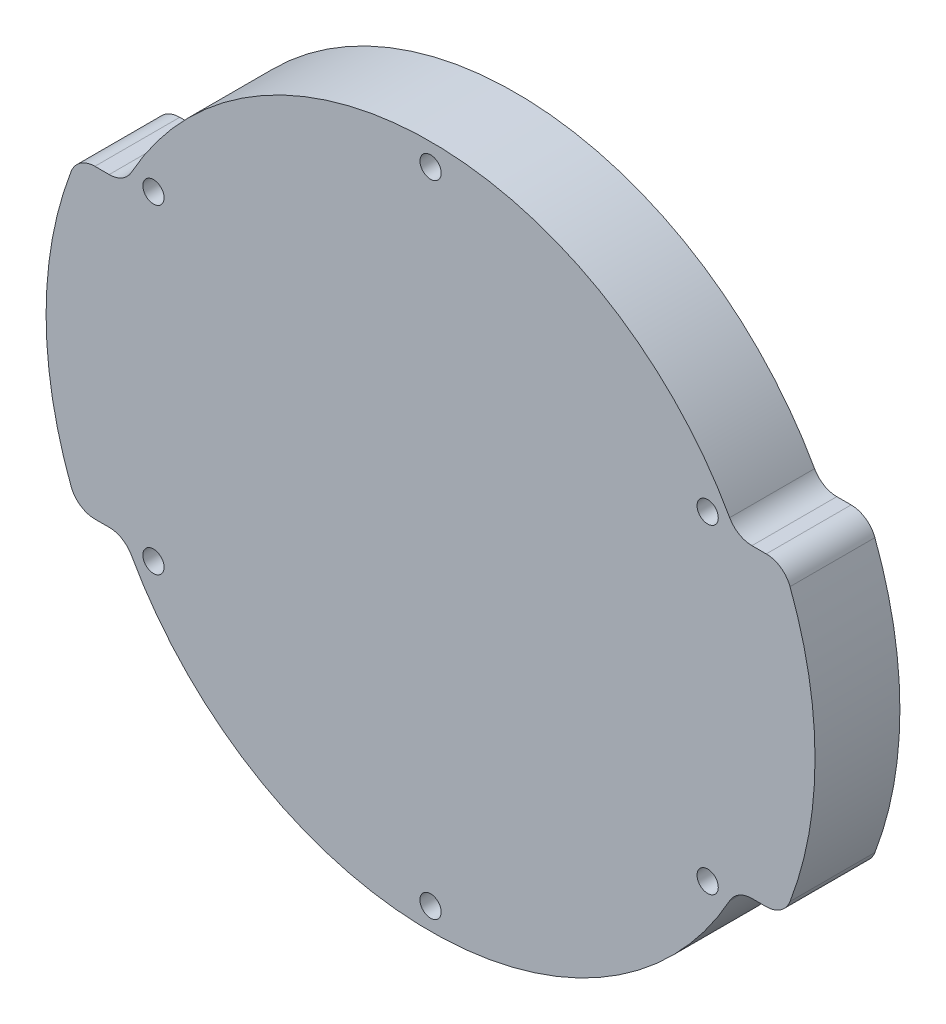
ISO-10303-21;
HEADER;
FILE_DESCRIPTION(('STEP AP214'),'2;1');
FILE_NAME('part.step','',(''),(''),'','','');
FILE_SCHEMA(('AUTOMOTIVE_DESIGN { 1 0 10303 214 1 1 1 1 }'));
ENDSEC;
DATA;
#1=APPLICATION_CONTEXT('core data for automotive mechanical design processes');
#2=APPLICATION_PROTOCOL_DEFINITION('international standard','automotive_design',2000,#1);
#3=PRODUCT_CONTEXT('',#1,'mechanical');
#4=PRODUCT('Part','Part','',(#3));
#5=PRODUCT_RELATED_PRODUCT_CATEGORY('part','',(#4));
#6=PRODUCT_DEFINITION_FORMATION('','',#4);
#7=PRODUCT_DEFINITION_CONTEXT('part definition',#1,'design');
#8=PRODUCT_DEFINITION('design','',#6,#7);
#9=PRODUCT_DEFINITION_SHAPE('','',#8);
#10=(LENGTH_UNIT() NAMED_UNIT(*) SI_UNIT(.MILLI.,.METRE.));
#11=(NAMED_UNIT(*) PLANE_ANGLE_UNIT() SI_UNIT($,.RADIAN.));
#12=(NAMED_UNIT(*) SI_UNIT($,.STERADIAN.) SOLID_ANGLE_UNIT());
#13=UNCERTAINTY_MEASURE_WITH_UNIT(LENGTH_MEASURE(1.E-05),#10,'distance_accuracy_value','');
#14=(GEOMETRIC_REPRESENTATION_CONTEXT(3) GLOBAL_UNCERTAINTY_ASSIGNED_CONTEXT((#13)) GLOBAL_UNIT_ASSIGNED_CONTEXT((#10,
#11,#12)) REPRESENTATION_CONTEXT('',''));
#15=CARTESIAN_POINT('',(0.,0.,0.));
#16=DIRECTION('',(0.,0.,1.));
#17=DIRECTION('',(1.,0.,0.));
#18=AXIS2_PLACEMENT_3D('',#15,#16,#17);
#19=CARTESIAN_POINT('',(0.,0.,10.));
#20=DIRECTION('',(0.,0.,-1.));
#21=DIRECTION('',(-1.,0.,0.));
#22=AXIS2_PLACEMENT_3D('',#19,#20,#21);
#23=CYLINDRICAL_SURFACE('',#22,45.3);
#24=CARTESIAN_POINT('',(0.,0.,0.));
#25=DIRECTION('',(0.,0.,1.));
#26=DIRECTION('',(1.,0.,0.));
#27=AXIS2_PLACEMENT_3D('',#24,#25,#26);
#28=CIRCLE('',#27,45.3);
#29=CARTESIAN_POINT('',(42.3561491706549,-16.063829787234,0.));
#30=VERTEX_POINT('',#29);
#31=CARTESIAN_POINT('',(42.3561491706549,16.063829787234,0.));
#32=VERTEX_POINT('',#31);
#33=EDGE_CURVE('E191',#30,#32,#28,.T.);
#34=ORIENTED_EDGE('',*,*,#33,.T.);
#35=DIRECTION('',(0.,0.,-1.));
#36=VECTOR('',#35,1.);
#37=CARTESIAN_POINT('',(42.3561491706549,16.063829787234,10.));
#38=LINE('',#37,#36);
#39=CARTESIAN_POINT('',(42.3561491706549,16.063829787234,10.));
#40=VERTEX_POINT('',#39);
#41=EDGE_CURVE('E201',#32,#40,#38,.F.);
#42=ORIENTED_EDGE('',*,*,#41,.T.);
#43=CARTESIAN_POINT('',(0.,0.,10.));
#44=DIRECTION('',(0.,0.,1.));
#45=DIRECTION('',(1.,0.,0.));
#46=AXIS2_PLACEMENT_3D('',#43,#44,#45);
#47=CIRCLE('',#46,45.3);
#48=CARTESIAN_POINT('',(42.3561491706549,-16.063829787234,10.));
#49=VERTEX_POINT('',#48);
#50=EDGE_CURVE('E187',#49,#40,#47,.T.);
#51=ORIENTED_EDGE('',*,*,#50,.F.);
#52=DIRECTION('',(0.,0.,-1.));
#53=VECTOR('',#52,1.);
#54=CARTESIAN_POINT('',(42.3561491706549,-16.063829787234,10.));
#55=LINE('',#54,#53);
#56=EDGE_CURVE('E198',#49,#30,#55,.T.);
#57=ORIENTED_EDGE('',*,*,#56,.T.);
#58=EDGE_LOOP('',(#34,#42,#51,#57));
#59=FACE_BOUND('',#58,.T.);
#60=ADVANCED_FACE('F33',(#59),#23,.T.);
#61=CARTESIAN_POINT('',(-42.3561491706549,16.063829787234,0.));
#62=VERTEX_POINT('',#61);
#63=CARTESIAN_POINT('',(-42.3561491706549,-16.063829787234,0.));
#64=VERTEX_POINT('',#63);
#65=EDGE_CURVE('E188',#62,#64,#28,.T.);
#66=ORIENTED_EDGE('',*,*,#65,.T.);
#67=DIRECTION('',(0.,0.,-1.));
#68=VECTOR('',#67,1.);
#69=CARTESIAN_POINT('',(-42.3561491706549,-16.063829787234,10.));
#70=LINE('',#69,#68);
#71=CARTESIAN_POINT('',(-42.3561491706549,-16.063829787234,10.));
#72=VERTEX_POINT('',#71);
#73=EDGE_CURVE('E234',#64,#72,#70,.F.);
#74=ORIENTED_EDGE('',*,*,#73,.T.);
#75=CARTESIAN_POINT('',(-42.3561491706549,16.063829787234,10.));
#76=VERTEX_POINT('',#75);
#77=EDGE_CURVE('E183',#76,#72,#47,.T.);
#78=ORIENTED_EDGE('',*,*,#77,.F.);
#79=DIRECTION('',(0.,0.,-1.));
#80=VECTOR('',#79,1.);
#81=CARTESIAN_POINT('',(-42.3561491706549,16.063829787234,10.));
#82=LINE('',#81,#80);
#83=EDGE_CURVE('E232',#76,#62,#82,.T.);
#84=ORIENTED_EDGE('',*,*,#83,.T.);
#85=EDGE_LOOP('',(#66,#74,#78,#84));
#86=FACE_BOUND('',#85,.T.);
#87=ADVANCED_FACE('F287',(#86),#23,.T.);
#88=CARTESIAN_POINT('',(0.,0.,10.));
#89=DIRECTION('',(0.,0.,1.));
#90=DIRECTION('',(1.,0.,0.));
#91=AXIS2_PLACEMENT_3D('',#88,#89,#90);
#92=PLANE('',#91);
#93=CARTESIAN_POINT('',(-32.6491577226728,18.8499999999991,10.));
#94=DIRECTION('',(0.,0.,1.));
#95=DIRECTION('',(1.,0.,0.));
#96=AXIS2_PLACEMENT_3D('',#93,#94,#95);
#97=CIRCLE('',#96,1.25000000000123);
#98=CARTESIAN_POINT('',(-31.3991577226716,18.8499999999991,10.));
#99=VERTEX_POINT('',#98);
#100=EDGE_CURVE('E348',#99,#99,#97,.T.);
#101=ORIENTED_EDGE('',*,*,#100,.F.);
#102=EDGE_LOOP('',(#101));
#103=FACE_BOUND('',#102,.T.);
#104=CARTESIAN_POINT('',(-32.6491577226717,-18.8500000000009,10.));
#105=DIRECTION('',(0.,0.,1.));
#106=DIRECTION('',(1.,0.,0.));
#107=AXIS2_PLACEMENT_3D('',#104,#105,#106);
#108=CIRCLE('',#107,1.25000000000215);
#109=CARTESIAN_POINT('',(-31.3991577226696,-18.8500000000009,10.));
#110=VERTEX_POINT('',#109);
#111=EDGE_CURVE('E350',#110,#110,#108,.T.);
#112=ORIENTED_EDGE('',*,*,#111,.F.);
#113=EDGE_LOOP('',(#112));
#114=FACE_BOUND('',#113,.T.);
#115=CARTESIAN_POINT('',(2.13376305418689E-12,-37.7,10.));
#116=DIRECTION('',(0.,0.,1.));
#117=DIRECTION('',(1.,0.,0.));
#118=AXIS2_PLACEMENT_3D('',#115,#116,#117);
#119=CIRCLE('',#118,1.25000000000229);
#120=CARTESIAN_POINT('',(1.25000000000443,-37.7,10.));
#121=VERTEX_POINT('',#120);
#122=EDGE_CURVE('E356',#121,#121,#119,.T.);
#123=ORIENTED_EDGE('',*,*,#122,.F.);
#124=EDGE_LOOP('',(#123));
#125=FACE_BOUND('',#124,.T.);
#126=CARTESIAN_POINT('',(32.6491577226749,-18.8499999999991,10.));
#127=DIRECTION('',(0.,0.,1.));
#128=DIRECTION('',(1.,0.,0.));
#129=AXIS2_PLACEMENT_3D('',#126,#127,#128);
#130=CIRCLE('',#129,1.25000000000144);
#131=CARTESIAN_POINT('',(33.8991577226764,-18.8499999999991,10.));
#132=VERTEX_POINT('',#131);
#133=EDGE_CURVE('E362',#132,#132,#130,.T.);
#134=ORIENTED_EDGE('',*,*,#133,.F.);
#135=EDGE_LOOP('',(#134));
#136=FACE_BOUND('',#135,.T.);
#137=CARTESIAN_POINT('',(32.6491577226739,18.8500000000009,10.));
#138=DIRECTION('',(0.,0.,1.));
#139=DIRECTION('',(1.,0.,0.));
#140=AXIS2_PLACEMENT_3D('',#137,#138,#139);
#141=CIRCLE('',#140,1.25000000000034);
#142=CARTESIAN_POINT('',(33.8991577226742,18.8500000000009,10.));
#143=VERTEX_POINT('',#142);
#144=EDGE_CURVE('E368',#143,#143,#141,.T.);
#145=ORIENTED_EDGE('',*,*,#144,.F.);
#146=EDGE_LOOP('',(#145));
#147=FACE_BOUND('',#146,.T.);
#148=CARTESIAN_POINT('',(0.,37.7,10.));
#149=DIRECTION('',(0.,0.,1.));
#150=DIRECTION('',(1.,0.,0.));
#151=AXIS2_PLACEMENT_3D('',#148,#149,#150);
#152=CIRCLE('',#151,1.25);
#153=CARTESIAN_POINT('',(1.25,37.7,10.));
#154=VERTEX_POINT('',#153);
#155=EDGE_CURVE('E374',#154,#154,#152,.T.);
#156=ORIENTED_EDGE('',*,*,#155,.F.);
#157=EDGE_LOOP('',(#156));
#158=FACE_BOUND('',#157,.T.);
#159=ORIENTED_EDGE('',*,*,#50,.T.);
#160=CARTESIAN_POINT('',(39.5511061792208,15.,10.));
#161=DIRECTION('',(0.,0.,1.));
#162=DIRECTION('',(1.,0.,0.));
#163=AXIS2_PLACEMENT_3D('',#160,#161,#162);
#164=CIRCLE('',#163,3.);
#165=CARTESIAN_POINT('',(39.5511061792208,18.,10.));
#166=VERTEX_POINT('',#165);
#167=EDGE_CURVE('E173',#40,#166,#164,.T.);
#168=ORIENTED_EDGE('',*,*,#167,.T.);
#169=DIRECTION('',(1.,0.,0.));
#170=VECTOR('',#169,1.);
#171=CARTESIAN_POINT('',(36.0567608084808,18.,10.));
#172=LINE('',#171,#170);
#173=CARTESIAN_POINT('',(37.8667400234031,18.,10.));
#174=VERTEX_POINT('',#173);
#175=EDGE_CURVE('E164',#174,#166,#172,.T.);
#176=ORIENTED_EDGE('',*,*,#175,.F.);
#177=CARTESIAN_POINT('',(37.8667400234031,21.,10.));
#178=DIRECTION('',(0.,0.,1.));
#179=DIRECTION('',(1.,0.,0.));
#180=AXIS2_PLACEMENT_3D('',#177,#178,#179);
#181=CIRCLE('',#180,3.);
#182=CARTESIAN_POINT('',(35.2431783589641,19.5450346420323,10.));
#183=VERTEX_POINT('',#182);
#184=EDGE_CURVE('E147',#174,#183,#181,.F.);
#185=ORIENTED_EDGE('',*,*,#184,.T.);
#186=CARTESIAN_POINT('',(0.,0.,10.));
#187=DIRECTION('',(0.,0.,-1.));
#188=DIRECTION('',(1.,0.,0.));
#189=AXIS2_PLACEMENT_3D('',#186,#187,#188);
#190=CIRCLE('',#189,40.3);
#191=CARTESIAN_POINT('',(-35.2431783589641,19.5450346420323,10.));
#192=VERTEX_POINT('',#191);
#193=EDGE_CURVE('E175',#192,#183,#190,.T.);
#194=ORIENTED_EDGE('',*,*,#193,.F.);
#195=CARTESIAN_POINT('',(-37.8667400234031,21.,10.));
#196=DIRECTION('',(0.,0.,1.));
#197=DIRECTION('',(1.,0.,0.));
#198=AXIS2_PLACEMENT_3D('',#195,#196,#197);
#199=CIRCLE('',#198,3.);
#200=CARTESIAN_POINT('',(-37.8667400234031,18.,10.));
#201=VERTEX_POINT('',#200);
#202=EDGE_CURVE('E41',#192,#201,#199,.F.);
#203=ORIENTED_EDGE('',*,*,#202,.T.);
#204=DIRECTION('',(1.,0.,0.));
#205=VECTOR('',#204,1.);
#206=CARTESIAN_POINT('',(-36.0567608084808,18.,10.));
#207=LINE('',#206,#205);
#208=CARTESIAN_POINT('',(-39.5511061792208,18.,10.));
#209=VERTEX_POINT('',#208);
#210=EDGE_CURVE('E174',#209,#201,#207,.T.);
#211=ORIENTED_EDGE('',*,*,#210,.F.);
#212=CARTESIAN_POINT('',(-39.5511061792208,15.,10.));
#213=DIRECTION('',(0.,0.,1.));
#214=DIRECTION('',(1.,0.,0.));
#215=AXIS2_PLACEMENT_3D('',#212,#213,#214);
#216=CIRCLE('',#215,3.);
#217=EDGE_CURVE('E204',#209,#76,#216,.T.);
#218=ORIENTED_EDGE('',*,*,#217,.T.);
#219=ORIENTED_EDGE('',*,*,#77,.T.);
#220=CARTESIAN_POINT('',(-39.5511061792208,-15.,10.));
#221=DIRECTION('',(0.,0.,1.));
#222=DIRECTION('',(1.,0.,0.));
#223=AXIS2_PLACEMENT_3D('',#220,#221,#222);
#224=CIRCLE('',#223,3.);
#225=CARTESIAN_POINT('',(-39.5511061792208,-18.,10.));
#226=VERTEX_POINT('',#225);
#227=EDGE_CURVE('E206',#72,#226,#224,.T.);
#228=ORIENTED_EDGE('',*,*,#227,.T.);
#229=DIRECTION('',(-1.,0.,0.));
#230=VECTOR('',#229,1.);
#231=CARTESIAN_POINT('',(-36.0567608084808,-18.,10.));
#232=LINE('',#231,#230);
#233=CARTESIAN_POINT('',(-37.8667400234031,-18.,10.));
#234=VERTEX_POINT('',#233);
#235=EDGE_CURVE('E389',#234,#226,#232,.T.);
#236=ORIENTED_EDGE('',*,*,#235,.F.);
#237=CARTESIAN_POINT('',(-37.8667400234031,-21.,10.));
#238=DIRECTION('',(0.,0.,1.));
#239=DIRECTION('',(1.,0.,0.));
#240=AXIS2_PLACEMENT_3D('',#237,#238,#239);
#241=CIRCLE('',#240,3.);
#242=CARTESIAN_POINT('',(-35.2431783589641,-19.5450346420323,10.));
#243=VERTEX_POINT('',#242);
#244=EDGE_CURVE('E245',#234,#243,#241,.F.);
#245=ORIENTED_EDGE('',*,*,#244,.T.);
#246=CARTESIAN_POINT('',(0.,0.,10.));
#247=DIRECTION('',(0.,0.,-1.));
#248=DIRECTION('',(1.,0.,0.));
#249=AXIS2_PLACEMENT_3D('',#246,#247,#248);
#250=CIRCLE('',#249,40.3);
#251=CARTESIAN_POINT('',(35.2431783589641,-19.5450346420323,10.));
#252=VERTEX_POINT('',#251);
#253=EDGE_CURVE('E380',#252,#243,#250,.T.);
#254=ORIENTED_EDGE('',*,*,#253,.F.);
#255=CARTESIAN_POINT('',(37.8667400234031,-21.,10.));
#256=DIRECTION('',(0.,0.,1.));
#257=DIRECTION('',(1.,0.,0.));
#258=AXIS2_PLACEMENT_3D('',#255,#256,#257);
#259=CIRCLE('',#258,3.);
#260=CARTESIAN_POINT('',(37.8667400234031,-18.,10.));
#261=VERTEX_POINT('',#260);
#262=EDGE_CURVE('E241',#252,#261,#259,.F.);
#263=ORIENTED_EDGE('',*,*,#262,.T.);
#264=DIRECTION('',(-1.,0.,0.));
#265=VECTOR('',#264,1.);
#266=CARTESIAN_POINT('',(36.0567608084808,-18.,10.));
#267=LINE('',#266,#265);
#268=CARTESIAN_POINT('',(39.5511061792208,-18.,10.));
#269=VERTEX_POINT('',#268);
#270=EDGE_CURVE('E263',#269,#261,#267,.T.);
#271=ORIENTED_EDGE('',*,*,#270,.F.);
#272=CARTESIAN_POINT('',(39.5511061792208,-15.,10.));
#273=DIRECTION('',(0.,0.,1.));
#274=DIRECTION('',(1.,0.,0.));
#275=AXIS2_PLACEMENT_3D('',#272,#273,#274);
#276=CIRCLE('',#275,3.);
#277=EDGE_CURVE('E208',#269,#49,#276,.T.);
#278=ORIENTED_EDGE('',*,*,#277,.T.);
#279=EDGE_LOOP('',(#159,#168,#176,#185,#194,#203,#211,#218,#219,#228,#236,#245,#254,#263,#271,#278));
#280=FACE_BOUND('',#279,.T.);
#281=ADVANCED_FACE('F172',(#103,#114,#125,#136,#147,#158,#280),#92,.T.);
#282=CARTESIAN_POINT('',(0.,0.,0.));
#283=DIRECTION('',(0.,0.,1.));
#284=DIRECTION('',(1.,0.,0.));
#285=AXIS2_PLACEMENT_3D('',#282,#283,#284);
#286=PLANE('',#285);
#287=CARTESIAN_POINT('',(-32.6491577226728,18.8499999999991,0.));
#288=DIRECTION('',(0.,0.,1.));
#289=DIRECTION('',(1.,0.,0.));
#290=AXIS2_PLACEMENT_3D('',#287,#288,#289);
#291=CIRCLE('',#290,1.25000000000123);
#292=CARTESIAN_POINT('',(-31.3991577226716,18.8499999999991,0.));
#293=VERTEX_POINT('',#292);
#294=EDGE_CURVE('E345',#293,#293,#291,.T.);
#295=ORIENTED_EDGE('',*,*,#294,.T.);
#296=EDGE_LOOP('',(#295));
#297=FACE_BOUND('',#296,.T.);
#298=CARTESIAN_POINT('',(-32.6491577226717,-18.8500000000009,0.));
#299=DIRECTION('',(0.,0.,1.));
#300=DIRECTION('',(1.,0.,0.));
#301=AXIS2_PLACEMENT_3D('',#298,#299,#300);
#302=CIRCLE('',#301,1.25000000000215);
#303=CARTESIAN_POINT('',(-31.3991577226696,-18.8500000000009,0.));
#304=VERTEX_POINT('',#303);
#305=EDGE_CURVE('E353',#304,#304,#302,.T.);
#306=ORIENTED_EDGE('',*,*,#305,.T.);
#307=EDGE_LOOP('',(#306));
#308=FACE_BOUND('',#307,.T.);
#309=CARTESIAN_POINT('',(2.13376305418689E-12,-37.7,0.));
#310=DIRECTION('',(0.,0.,1.));
#311=DIRECTION('',(1.,0.,0.));
#312=AXIS2_PLACEMENT_3D('',#309,#310,#311);
#313=CIRCLE('',#312,1.25000000000229);
#314=CARTESIAN_POINT('',(1.25000000000443,-37.7,0.));
#315=VERTEX_POINT('',#314);
#316=EDGE_CURVE('E359',#315,#315,#313,.T.);
#317=ORIENTED_EDGE('',*,*,#316,.T.);
#318=EDGE_LOOP('',(#317));
#319=FACE_BOUND('',#318,.T.);
#320=CARTESIAN_POINT('',(32.6491577226749,-18.8499999999991,0.));
#321=DIRECTION('',(0.,0.,1.));
#322=DIRECTION('',(1.,0.,0.));
#323=AXIS2_PLACEMENT_3D('',#320,#321,#322);
#324=CIRCLE('',#323,1.25000000000144);
#325=CARTESIAN_POINT('',(33.8991577226764,-18.8499999999991,0.));
#326=VERTEX_POINT('',#325);
#327=EDGE_CURVE('E365',#326,#326,#324,.T.);
#328=ORIENTED_EDGE('',*,*,#327,.T.);
#329=EDGE_LOOP('',(#328));
#330=FACE_BOUND('',#329,.T.);
#331=CARTESIAN_POINT('',(32.6491577226739,18.8500000000009,0.));
#332=DIRECTION('',(0.,0.,1.));
#333=DIRECTION('',(1.,0.,0.));
#334=AXIS2_PLACEMENT_3D('',#331,#332,#333);
#335=CIRCLE('',#334,1.25000000000034);
#336=CARTESIAN_POINT('',(33.8991577226742,18.8500000000009,0.));
#337=VERTEX_POINT('',#336);
#338=EDGE_CURVE('E371',#337,#337,#335,.T.);
#339=ORIENTED_EDGE('',*,*,#338,.T.);
#340=EDGE_LOOP('',(#339));
#341=FACE_BOUND('',#340,.T.);
#342=CARTESIAN_POINT('',(0.,37.7,0.));
#343=DIRECTION('',(0.,0.,1.));
#344=DIRECTION('',(1.,0.,0.));
#345=AXIS2_PLACEMENT_3D('',#342,#343,#344);
#346=CIRCLE('',#345,1.25);
#347=CARTESIAN_POINT('',(1.25,37.7,0.));
#348=VERTEX_POINT('',#347);
#349=EDGE_CURVE('E377',#348,#348,#346,.T.);
#350=ORIENTED_EDGE('',*,*,#349,.T.);
#351=EDGE_LOOP('',(#350));
#352=FACE_BOUND('',#351,.T.);
#353=DIRECTION('',(1.,0.,0.));
#354=VECTOR('',#353,1.);
#355=CARTESIAN_POINT('',(36.0567608084808,18.,0.));
#356=LINE('',#355,#354);
#357=CARTESIAN_POINT('',(37.8667400234031,18.,0.));
#358=VERTEX_POINT('',#357);
#359=CARTESIAN_POINT('',(39.5511061792208,18.,0.));
#360=VERTEX_POINT('',#359);
#361=EDGE_CURVE('E167',#358,#360,#356,.T.);
#362=ORIENTED_EDGE('',*,*,#361,.T.);
#363=CARTESIAN_POINT('',(39.5511061792208,15.,0.));
#364=DIRECTION('',(0.,0.,1.));
#365=DIRECTION('',(1.,0.,0.));
#366=AXIS2_PLACEMENT_3D('',#363,#364,#365);
#367=CIRCLE('',#366,3.);
#368=EDGE_CURVE('E216',#360,#32,#367,.F.);
#369=ORIENTED_EDGE('',*,*,#368,.T.);
#370=ORIENTED_EDGE('',*,*,#33,.F.);
#371=CARTESIAN_POINT('',(39.5511061792208,-15.,0.));
#372=DIRECTION('',(0.,0.,1.));
#373=DIRECTION('',(1.,0.,0.));
#374=AXIS2_PLACEMENT_3D('',#371,#372,#373);
#375=CIRCLE('',#374,3.);
#376=CARTESIAN_POINT('',(39.5511061792208,-18.,0.));
#377=VERTEX_POINT('',#376);
#378=EDGE_CURVE('E214',#30,#377,#375,.F.);
#379=ORIENTED_EDGE('',*,*,#378,.T.);
#380=DIRECTION('',(-1.,0.,0.));
#381=VECTOR('',#380,1.);
#382=CARTESIAN_POINT('',(0.,-18.,0.));
#383=LINE('',#382,#381);
#384=CARTESIAN_POINT('',(37.8667400234031,-18.,0.));
#385=VERTEX_POINT('',#384);
#386=EDGE_CURVE('E186',#377,#385,#383,.T.);
#387=ORIENTED_EDGE('',*,*,#386,.T.);
#388=CARTESIAN_POINT('',(37.8667400234031,-21.,0.));
#389=DIRECTION('',(0.,0.,1.));
#390=DIRECTION('',(1.,0.,0.));
#391=AXIS2_PLACEMENT_3D('',#388,#389,#390);
#392=CIRCLE('',#391,3.);
#393=CARTESIAN_POINT('',(35.2431783589641,-19.5450346420323,0.));
#394=VERTEX_POINT('',#393);
#395=EDGE_CURVE('E243',#385,#394,#392,.T.);
#396=ORIENTED_EDGE('',*,*,#395,.T.);
#397=CARTESIAN_POINT('',(0.,0.,0.));
#398=DIRECTION('',(0.,0.,-1.));
#399=DIRECTION('',(1.,0.,0.));
#400=AXIS2_PLACEMENT_3D('',#397,#398,#399);
#401=CIRCLE('',#400,40.3);
#402=CARTESIAN_POINT('',(-35.2431783589641,-19.5450346420323,0.));
#403=VERTEX_POINT('',#402);
#404=EDGE_CURVE('E383',#394,#403,#401,.T.);
#405=ORIENTED_EDGE('',*,*,#404,.T.);
#406=CARTESIAN_POINT('',(-37.8667400234031,-21.,0.));
#407=DIRECTION('',(0.,0.,1.));
#408=DIRECTION('',(1.,0.,0.));
#409=AXIS2_PLACEMENT_3D('',#406,#407,#408);
#410=CIRCLE('',#409,3.);
#411=CARTESIAN_POINT('',(-37.8667400234031,-18.,0.));
#412=VERTEX_POINT('',#411);
#413=EDGE_CURVE('E247',#403,#412,#410,.T.);
#414=ORIENTED_EDGE('',*,*,#413,.T.);
#415=DIRECTION('',(-1.,0.,0.));
#416=VECTOR('',#415,1.);
#417=CARTESIAN_POINT('',(-36.0567608084808,-18.,0.));
#418=LINE('',#417,#416);
#419=CARTESIAN_POINT('',(-39.5511061792208,-18.,0.));
#420=VERTEX_POINT('',#419);
#421=EDGE_CURVE('E179',#412,#420,#418,.T.);
#422=ORIENTED_EDGE('',*,*,#421,.T.);
#423=CARTESIAN_POINT('',(-39.5511061792208,-15.,0.));
#424=DIRECTION('',(0.,0.,1.));
#425=DIRECTION('',(1.,0.,0.));
#426=AXIS2_PLACEMENT_3D('',#423,#424,#425);
#427=CIRCLE('',#426,3.);
#428=EDGE_CURVE('E212',#420,#64,#427,.F.);
#429=ORIENTED_EDGE('',*,*,#428,.T.);
#430=ORIENTED_EDGE('',*,*,#65,.F.);
#431=CARTESIAN_POINT('',(-39.5511061792208,15.,0.));
#432=DIRECTION('',(0.,0.,1.));
#433=DIRECTION('',(1.,0.,0.));
#434=AXIS2_PLACEMENT_3D('',#431,#432,#433);
#435=CIRCLE('',#434,3.);
#436=CARTESIAN_POINT('',(-39.5511061792208,18.,0.));
#437=VERTEX_POINT('',#436);
#438=EDGE_CURVE('E55',#62,#437,#435,.F.);
#439=ORIENTED_EDGE('',*,*,#438,.T.);
#440=DIRECTION('',(1.,0.,0.));
#441=VECTOR('',#440,1.);
#442=CARTESIAN_POINT('',(-36.0567608084808,18.,0.));
#443=LINE('',#442,#441);
#444=CARTESIAN_POINT('',(-37.8667400234031,18.,0.));
#445=VERTEX_POINT('',#444);
#446=EDGE_CURVE('E257',#437,#445,#443,.T.);
#447=ORIENTED_EDGE('',*,*,#446,.T.);
#448=CARTESIAN_POINT('',(-37.8667400234031,21.,0.));
#449=DIRECTION('',(0.,0.,1.));
#450=DIRECTION('',(1.,0.,0.));
#451=AXIS2_PLACEMENT_3D('',#448,#449,#450);
#452=CIRCLE('',#451,3.);
#453=CARTESIAN_POINT('',(-35.2431783589641,19.5450346420323,0.));
#454=VERTEX_POINT('',#453);
#455=EDGE_CURVE('E11',#445,#454,#452,.T.);
#456=ORIENTED_EDGE('',*,*,#455,.T.);
#457=CARTESIAN_POINT('',(0.,0.,0.));
#458=DIRECTION('',(0.,0.,-1.));
#459=DIRECTION('',(1.,0.,0.));
#460=AXIS2_PLACEMENT_3D('',#457,#458,#459);
#461=CIRCLE('',#460,40.3);
#462=CARTESIAN_POINT('',(35.2431783589641,19.5450346420323,0.));
#463=VERTEX_POINT('',#462);
#464=EDGE_CURVE('E177',#454,#463,#461,.T.);
#465=ORIENTED_EDGE('',*,*,#464,.T.);
#466=CARTESIAN_POINT('',(37.8667400234031,21.,0.));
#467=DIRECTION('',(0.,0.,1.));
#468=DIRECTION('',(1.,0.,0.));
#469=AXIS2_PLACEMENT_3D('',#466,#467,#468);
#470=CIRCLE('',#469,3.);
#471=EDGE_CURVE('E157',#463,#358,#470,.T.);
#472=ORIENTED_EDGE('',*,*,#471,.T.);
#473=EDGE_LOOP('',(#362,#369,#370,#379,#387,#396,#405,#414,#422,#429,#430,#439,#447,#456,#465,#472));
#474=FACE_BOUND('',#473,.T.);
#475=ADVANCED_FACE('F256',(#297,#308,#319,#330,#341,#352,#474),#286,.F.);
#476=CARTESIAN_POINT('',(0.,0.,0.));
#477=DIRECTION('',(0.,0.,1.));
#478=DIRECTION('',(1.,0.,0.));
#479=AXIS2_PLACEMENT_3D('',#476,#477,#478);
#480=CYLINDRICAL_SURFACE('',#479,40.3);
#481=ORIENTED_EDGE('',*,*,#193,.T.);
#482=DIRECTION('',(0.,0.,1.));
#483=VECTOR('',#482,1.);
#484=CARTESIAN_POINT('',(35.2431783589641,19.5450346420323,0.));
#485=LINE('',#484,#483);
#486=EDGE_CURVE('E152',#183,#463,#485,.F.);
#487=ORIENTED_EDGE('',*,*,#486,.T.);
#488=ORIENTED_EDGE('',*,*,#464,.F.);
#489=DIRECTION('',(0.,0.,1.));
#490=VECTOR('',#489,1.);
#491=CARTESIAN_POINT('',(-35.2431783589641,19.5450346420323,0.));
#492=LINE('',#491,#490);
#493=EDGE_CURVE('E168',#454,#192,#492,.T.);
#494=ORIENTED_EDGE('',*,*,#493,.T.);
#495=EDGE_LOOP('',(#481,#487,#488,#494));
#496=FACE_BOUND('',#495,.T.);
#497=ADVANCED_FACE('F259',(#496),#480,.T.);
#498=CARTESIAN_POINT('',(-36.0567608084808,18.,0.));
#499=DIRECTION('',(0.,-1.,0.));
#500=DIRECTION('',(1.,0.,0.));
#501=AXIS2_PLACEMENT_3D('',#498,#499,#500);
#502=PLANE('',#501);
#503=ORIENTED_EDGE('',*,*,#446,.F.);
#504=DIRECTION('',(0.,0.,-1.));
#505=VECTOR('',#504,1.);
#506=CARTESIAN_POINT('',(-39.5511061792208,18.,0.));
#507=LINE('',#506,#505);
#508=EDGE_CURVE('E158',#437,#209,#507,.F.);
#509=ORIENTED_EDGE('',*,*,#508,.T.);
#510=ORIENTED_EDGE('',*,*,#210,.T.);
#511=DIRECTION('',(0.,0.,-1.));
#512=VECTOR('',#511,1.);
#513=CARTESIAN_POINT('',(-37.8667400234031,18.,0.));
#514=LINE('',#513,#512);
#515=EDGE_CURVE('E48',#201,#445,#514,.T.);
#516=ORIENTED_EDGE('',*,*,#515,.T.);
#517=EDGE_LOOP('',(#503,#509,#510,#516));
#518=FACE_BOUND('',#517,.T.);
#519=ADVANCED_FACE('F251',(#518),#502,.F.);
#520=CARTESIAN_POINT('',(36.0567608084808,18.,0.));
#521=DIRECTION('',(0.,-1.,0.));
#522=DIRECTION('',(1.,0.,0.));
#523=AXIS2_PLACEMENT_3D('',#520,#521,#522);
#524=PLANE('',#523);
#525=ORIENTED_EDGE('',*,*,#361,.F.);
#526=DIRECTION('',(0.,0.,-1.));
#527=VECTOR('',#526,1.);
#528=CARTESIAN_POINT('',(37.8667400234031,18.,10.));
#529=LINE('',#528,#527);
#530=EDGE_CURVE('E151',#358,#174,#529,.F.);
#531=ORIENTED_EDGE('',*,*,#530,.T.);
#532=ORIENTED_EDGE('',*,*,#175,.T.);
#533=DIRECTION('',(0.,0.,-1.));
#534=VECTOR('',#533,1.);
#535=CARTESIAN_POINT('',(39.5511061792208,18.,0.));
#536=LINE('',#535,#534);
#537=EDGE_CURVE('E169',#166,#360,#536,.T.);
#538=ORIENTED_EDGE('',*,*,#537,.T.);
#539=EDGE_LOOP('',(#525,#531,#532,#538));
#540=FACE_BOUND('',#539,.T.);
#541=ADVANCED_FACE('F163',(#540),#524,.F.);
#542=CARTESIAN_POINT('',(36.0567608084808,-18.,0.));
#543=DIRECTION('',(0.,1.,0.));
#544=DIRECTION('',(0.,0.,1.));
#545=AXIS2_PLACEMENT_3D('',#542,#543,#544);
#546=PLANE('',#545);
#547=ORIENTED_EDGE('',*,*,#386,.F.);
#548=DIRECTION('',(0.,0.,-1.));
#549=VECTOR('',#548,1.);
#550=CARTESIAN_POINT('',(39.5511061792208,-18.,0.));
#551=LINE('',#550,#549);
#552=EDGE_CURVE('E220',#377,#269,#551,.F.);
#553=ORIENTED_EDGE('',*,*,#552,.T.);
#554=ORIENTED_EDGE('',*,*,#270,.T.);
#555=DIRECTION('',(0.,0.,-1.));
#556=VECTOR('',#555,1.);
#557=CARTESIAN_POINT('',(37.8667400234031,-18.,0.));
#558=LINE('',#557,#556);
#559=EDGE_CURVE('E218',#261,#385,#558,.T.);
#560=ORIENTED_EDGE('',*,*,#559,.T.);
#561=EDGE_LOOP('',(#547,#553,#554,#560));
#562=FACE_BOUND('',#561,.T.);
#563=ADVANCED_FACE('F304',(#562),#546,.F.);
#564=CARTESIAN_POINT('',(-36.0567608084808,-18.,0.));
#565=DIRECTION('',(0.,1.,0.));
#566=DIRECTION('',(0.,0.,1.));
#567=AXIS2_PLACEMENT_3D('',#564,#565,#566);
#568=PLANE('',#567);
#569=ORIENTED_EDGE('',*,*,#421,.F.);
#570=DIRECTION('',(0.,0.,-1.));
#571=VECTOR('',#570,1.);
#572=CARTESIAN_POINT('',(-37.8667400234031,-18.,10.));
#573=LINE('',#572,#571);
#574=EDGE_CURVE('E229',#412,#234,#573,.F.);
#575=ORIENTED_EDGE('',*,*,#574,.T.);
#576=ORIENTED_EDGE('',*,*,#235,.T.);
#577=DIRECTION('',(0.,0.,-1.));
#578=VECTOR('',#577,1.);
#579=CARTESIAN_POINT('',(-39.5511061792208,-18.,0.));
#580=LINE('',#579,#578);
#581=EDGE_CURVE('E227',#226,#420,#580,.T.);
#582=ORIENTED_EDGE('',*,*,#581,.T.);
#583=EDGE_LOOP('',(#569,#575,#576,#582));
#584=FACE_BOUND('',#583,.T.);
#585=ADVANCED_FACE('F309',(#584),#568,.F.);
#586=CARTESIAN_POINT('',(0.,0.,0.));
#587=DIRECTION('',(0.,0.,1.));
#588=DIRECTION('',(1.,0.,0.));
#589=AXIS2_PLACEMENT_3D('',#586,#587,#588);
#590=CYLINDRICAL_SURFACE('',#589,40.3);
#591=ORIENTED_EDGE('',*,*,#404,.F.);
#592=DIRECTION('',(0.,0.,1.));
#593=VECTOR('',#592,1.);
#594=CARTESIAN_POINT('',(35.2431783589641,-19.5450346420323,0.));
#595=LINE('',#594,#593);
#596=EDGE_CURVE('E224',#394,#252,#595,.T.);
#597=ORIENTED_EDGE('',*,*,#596,.T.);
#598=ORIENTED_EDGE('',*,*,#253,.T.);
#599=DIRECTION('',(0.,0.,1.));
#600=VECTOR('',#599,1.);
#601=CARTESIAN_POINT('',(-35.2431783589641,-19.5450346420323,0.));
#602=LINE('',#601,#600);
#603=EDGE_CURVE('E222',#243,#403,#602,.F.);
#604=ORIENTED_EDGE('',*,*,#603,.T.);
#605=EDGE_LOOP('',(#591,#597,#598,#604));
#606=FACE_BOUND('',#605,.T.);
#607=ADVANCED_FACE('F284',(#606),#590,.T.);
#608=CARTESIAN_POINT('',(37.8667400234031,21.,0.));
#609=DIRECTION('',(0.,0.,1.));
#610=DIRECTION('',(1.,0.,0.));
#611=AXIS2_PLACEMENT_3D('',#608,#609,#610);
#612=CYLINDRICAL_SURFACE('',#611,3.);
#613=ORIENTED_EDGE('',*,*,#471,.F.);
#614=ORIENTED_EDGE('',*,*,#486,.F.);
#615=ORIENTED_EDGE('',*,*,#184,.F.);
#616=ORIENTED_EDGE('',*,*,#530,.F.);
#617=EDGE_LOOP('',(#613,#614,#615,#616));
#618=FACE_BOUND('',#617,.T.);
#619=ADVANCED_FACE('F150',(#618),#612,.F.);
#620=CARTESIAN_POINT('',(39.5511061792208,15.,10.));
#621=DIRECTION('',(0.,0.,-1.));
#622=DIRECTION('',(-1.,0.,0.));
#623=AXIS2_PLACEMENT_3D('',#620,#621,#622);
#624=CYLINDRICAL_SURFACE('',#623,3.);
#625=ORIENTED_EDGE('',*,*,#368,.F.);
#626=ORIENTED_EDGE('',*,*,#537,.F.);
#627=ORIENTED_EDGE('',*,*,#167,.F.);
#628=ORIENTED_EDGE('',*,*,#41,.F.);
#629=EDGE_LOOP('',(#625,#626,#627,#628));
#630=FACE_BOUND('',#629,.T.);
#631=ADVANCED_FACE('F273',(#630),#624,.T.);
#632=CARTESIAN_POINT('',(39.5511061792208,-15.,10.));
#633=DIRECTION('',(0.,0.,-1.));
#634=DIRECTION('',(-1.,0.,0.));
#635=AXIS2_PLACEMENT_3D('',#632,#633,#634);
#636=CYLINDRICAL_SURFACE('',#635,3.);
#637=ORIENTED_EDGE('',*,*,#277,.F.);
#638=ORIENTED_EDGE('',*,*,#552,.F.);
#639=ORIENTED_EDGE('',*,*,#378,.F.);
#640=ORIENTED_EDGE('',*,*,#56,.F.);
#641=EDGE_LOOP('',(#637,#638,#639,#640));
#642=FACE_BOUND('',#641,.T.);
#643=ADVANCED_FACE('F275',(#642),#636,.T.);
#644=CARTESIAN_POINT('',(37.8667400234031,-21.,0.));
#645=DIRECTION('',(0.,0.,1.));
#646=DIRECTION('',(1.,0.,0.));
#647=AXIS2_PLACEMENT_3D('',#644,#645,#646);
#648=CYLINDRICAL_SURFACE('',#647,3.);
#649=ORIENTED_EDGE('',*,*,#395,.F.);
#650=ORIENTED_EDGE('',*,*,#559,.F.);
#651=ORIENTED_EDGE('',*,*,#262,.F.);
#652=ORIENTED_EDGE('',*,*,#596,.F.);
#653=EDGE_LOOP('',(#649,#650,#651,#652));
#654=FACE_BOUND('',#653,.T.);
#655=ADVANCED_FACE('F281',(#654),#648,.F.);
#656=CARTESIAN_POINT('',(-37.8667400234031,-21.,0.));
#657=DIRECTION('',(0.,0.,1.));
#658=DIRECTION('',(1.,0.,0.));
#659=AXIS2_PLACEMENT_3D('',#656,#657,#658);
#660=CYLINDRICAL_SURFACE('',#659,3.);
#661=ORIENTED_EDGE('',*,*,#413,.F.);
#662=ORIENTED_EDGE('',*,*,#603,.F.);
#663=ORIENTED_EDGE('',*,*,#244,.F.);
#664=ORIENTED_EDGE('',*,*,#574,.F.);
#665=EDGE_LOOP('',(#661,#662,#663,#664));
#666=FACE_BOUND('',#665,.T.);
#667=ADVANCED_FACE('F407',(#666),#660,.F.);
#668=CARTESIAN_POINT('',(-39.5511061792208,-15.,10.));
#669=DIRECTION('',(0.,0.,-1.));
#670=DIRECTION('',(-1.,0.,0.));
#671=AXIS2_PLACEMENT_3D('',#668,#669,#670);
#672=CYLINDRICAL_SURFACE('',#671,3.);
#673=ORIENTED_EDGE('',*,*,#428,.F.);
#674=ORIENTED_EDGE('',*,*,#581,.F.);
#675=ORIENTED_EDGE('',*,*,#227,.F.);
#676=ORIENTED_EDGE('',*,*,#73,.F.);
#677=EDGE_LOOP('',(#673,#674,#675,#676));
#678=FACE_BOUND('',#677,.T.);
#679=ADVANCED_FACE('F412',(#678),#672,.T.);
#680=CARTESIAN_POINT('',(-39.5511061792208,15.,10.));
#681=DIRECTION('',(0.,0.,-1.));
#682=DIRECTION('',(-1.,0.,0.));
#683=AXIS2_PLACEMENT_3D('',#680,#681,#682);
#684=CYLINDRICAL_SURFACE('',#683,3.);
#685=ORIENTED_EDGE('',*,*,#438,.F.);
#686=ORIENTED_EDGE('',*,*,#83,.F.);
#687=ORIENTED_EDGE('',*,*,#217,.F.);
#688=ORIENTED_EDGE('',*,*,#508,.F.);
#689=EDGE_LOOP('',(#685,#686,#687,#688));
#690=FACE_BOUND('',#689,.T.);
#691=ADVANCED_FACE('F417',(#690),#684,.T.);
#692=CARTESIAN_POINT('',(-37.8667400234031,21.,0.));
#693=DIRECTION('',(0.,0.,1.));
#694=DIRECTION('',(1.,0.,0.));
#695=AXIS2_PLACEMENT_3D('',#692,#693,#694);
#696=CYLINDRICAL_SURFACE('',#695,3.);
#697=ORIENTED_EDGE('',*,*,#455,.F.);
#698=ORIENTED_EDGE('',*,*,#515,.F.);
#699=ORIENTED_EDGE('',*,*,#202,.F.);
#700=ORIENTED_EDGE('',*,*,#493,.F.);
#701=EDGE_LOOP('',(#697,#698,#699,#700));
#702=FACE_BOUND('',#701,.T.);
#703=ADVANCED_FACE('F35',(#702),#696,.F.);
#704=CARTESIAN_POINT('',(0.,37.7,0.));
#705=DIRECTION('',(0.,0.,1.));
#706=DIRECTION('',(1.,0.,0.));
#707=AXIS2_PLACEMENT_3D('',#704,#705,#706);
#708=CYLINDRICAL_SURFACE('',#707,1.25);
#709=ORIENTED_EDGE('',*,*,#349,.F.);
#710=EDGE_LOOP('',(#709));
#711=FACE_BOUND('',#710,.T.);
#712=ORIENTED_EDGE('',*,*,#155,.T.);
#713=EDGE_LOOP('',(#712));
#714=FACE_BOUND('',#713,.T.);
#715=ADVANCED_FACE('F317',(#711,#714),#708,.F.);
#716=CARTESIAN_POINT('',(32.6491577226739,18.8500000000009,0.));
#717=DIRECTION('',(0.,0.,1.));
#718=DIRECTION('',(1.,0.,0.));
#719=AXIS2_PLACEMENT_3D('',#716,#717,#718);
#720=CYLINDRICAL_SURFACE('',#719,1.25000000000034);
#721=ORIENTED_EDGE('',*,*,#338,.F.);
#722=EDGE_LOOP('',(#721));
#723=FACE_BOUND('',#722,.T.);
#724=ORIENTED_EDGE('',*,*,#144,.T.);
#725=EDGE_LOOP('',(#724));
#726=FACE_BOUND('',#725,.T.);
#727=ADVANCED_FACE('F320',(#723,#726),#720,.F.);
#728=CARTESIAN_POINT('',(32.6491577226749,-18.8499999999991,0.));
#729=DIRECTION('',(0.,0.,1.));
#730=DIRECTION('',(1.,0.,0.));
#731=AXIS2_PLACEMENT_3D('',#728,#729,#730);
#732=CYLINDRICAL_SURFACE('',#731,1.25000000000144);
#733=ORIENTED_EDGE('',*,*,#327,.F.);
#734=EDGE_LOOP('',(#733));
#735=FACE_BOUND('',#734,.T.);
#736=ORIENTED_EDGE('',*,*,#133,.T.);
#737=EDGE_LOOP('',(#736));
#738=FACE_BOUND('',#737,.T.);
#739=ADVANCED_FACE('F324',(#735,#738),#732,.F.);
#740=CARTESIAN_POINT('',(2.13376305418689E-12,-37.7,0.));
#741=DIRECTION('',(0.,0.,1.));
#742=DIRECTION('',(1.,0.,0.));
#743=AXIS2_PLACEMENT_3D('',#740,#741,#742);
#744=CYLINDRICAL_SURFACE('',#743,1.25000000000229);
#745=ORIENTED_EDGE('',*,*,#316,.F.);
#746=EDGE_LOOP('',(#745));
#747=FACE_BOUND('',#746,.T.);
#748=ORIENTED_EDGE('',*,*,#122,.T.);
#749=EDGE_LOOP('',(#748));
#750=FACE_BOUND('',#749,.T.);
#751=ADVANCED_FACE('F328',(#747,#750),#744,.F.);
#752=CARTESIAN_POINT('',(-32.6491577226717,-18.8500000000009,0.));
#753=DIRECTION('',(0.,0.,1.));
#754=DIRECTION('',(1.,0.,0.));
#755=AXIS2_PLACEMENT_3D('',#752,#753,#754);
#756=CYLINDRICAL_SURFACE('',#755,1.25000000000215);
#757=ORIENTED_EDGE('',*,*,#305,.F.);
#758=EDGE_LOOP('',(#757));
#759=FACE_BOUND('',#758,.T.);
#760=ORIENTED_EDGE('',*,*,#111,.T.);
#761=EDGE_LOOP('',(#760));
#762=FACE_BOUND('',#761,.T.);
#763=ADVANCED_FACE('F332',(#759,#762),#756,.F.);
#764=CARTESIAN_POINT('',(-32.6491577226728,18.8499999999991,0.));
#765=DIRECTION('',(0.,0.,1.));
#766=DIRECTION('',(1.,0.,0.));
#767=AXIS2_PLACEMENT_3D('',#764,#765,#766);
#768=CYLINDRICAL_SURFACE('',#767,1.25000000000123);
#769=ORIENTED_EDGE('',*,*,#294,.F.);
#770=EDGE_LOOP('',(#769));
#771=FACE_BOUND('',#770,.T.);
#772=ORIENTED_EDGE('',*,*,#100,.T.);
#773=EDGE_LOOP('',(#772));
#774=FACE_BOUND('',#773,.T.);
#775=ADVANCED_FACE('F336',(#771,#774),#768,.F.);
#776=CLOSED_SHELL('',(#60,#87,#281,#475,#497,#519,#541,#563,#585,#607,#619,#631,#643,#655,#667,
#679,#691,#703,#715,#727,#739,#751,#763,#775));
#777=MANIFOLD_SOLID_BREP('B2',#776);
#778=ADVANCED_BREP_SHAPE_REPRESENTATION('',(#18,#777),#14);
#779=SHAPE_DEFINITION_REPRESENTATION(#9,#778);
ENDSEC;
END-ISO-10303-21;
